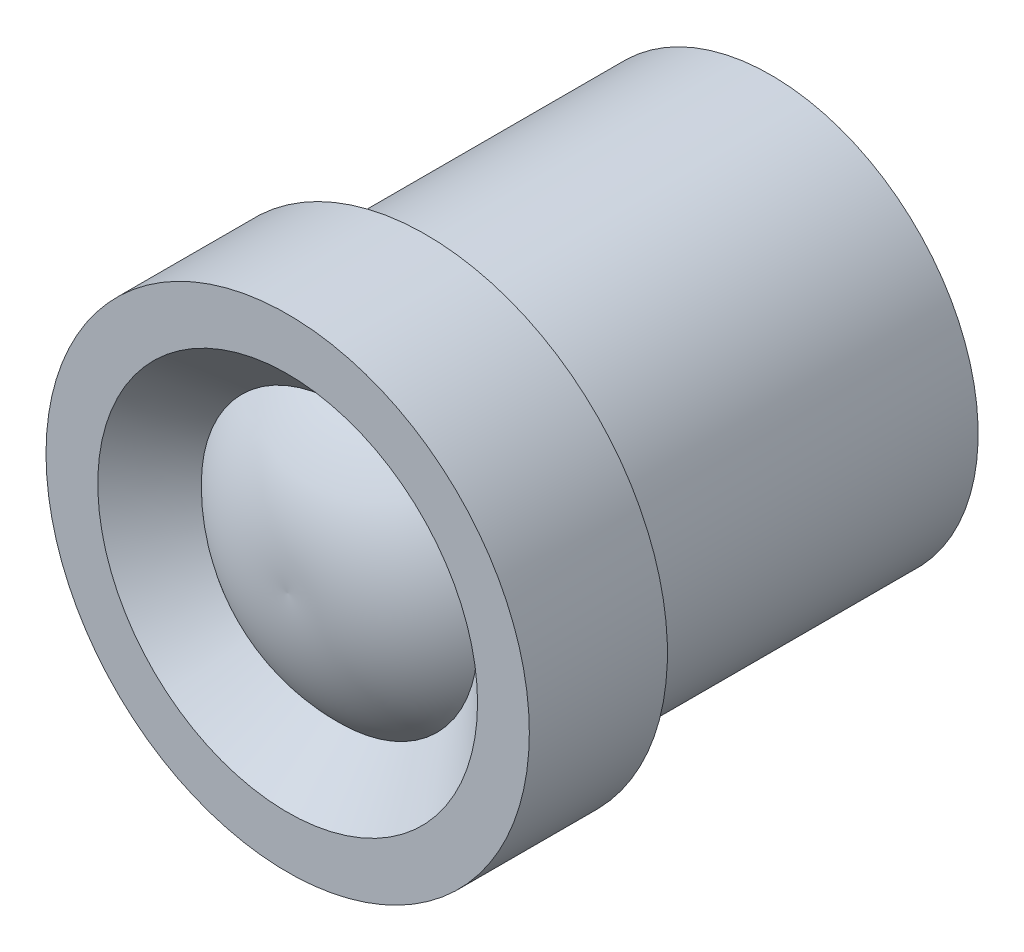
ISO-10303-21;
HEADER;
FILE_DESCRIPTION(('STEP AP214'),'2;1');
FILE_NAME('part.step','',(''),(''),'','','');
FILE_SCHEMA(('AUTOMOTIVE_DESIGN { 1 0 10303 214 1 1 1 1 }'));
ENDSEC;
DATA;
#1=APPLICATION_CONTEXT('core data for automotive mechanical design processes');
#2=APPLICATION_PROTOCOL_DEFINITION('international standard','automotive_design',2000,#1);
#3=PRODUCT_CONTEXT('',#1,'mechanical');
#4=PRODUCT('Part','Part','',(#3));
#5=PRODUCT_RELATED_PRODUCT_CATEGORY('part','',(#4));
#6=PRODUCT_DEFINITION_FORMATION('','',#4);
#7=PRODUCT_DEFINITION_CONTEXT('part definition',#1,'design');
#8=PRODUCT_DEFINITION('design','',#6,#7);
#9=PRODUCT_DEFINITION_SHAPE('','',#8);
#10=(LENGTH_UNIT() NAMED_UNIT(*) SI_UNIT(.MILLI.,.METRE.));
#11=(NAMED_UNIT(*) PLANE_ANGLE_UNIT() SI_UNIT($,.RADIAN.));
#12=(NAMED_UNIT(*) SI_UNIT($,.STERADIAN.) SOLID_ANGLE_UNIT());
#13=UNCERTAINTY_MEASURE_WITH_UNIT(LENGTH_MEASURE(1.E-05),#10,'distance_accuracy_value','');
#14=(GEOMETRIC_REPRESENTATION_CONTEXT(3) GLOBAL_UNCERTAINTY_ASSIGNED_CONTEXT((#13)) GLOBAL_UNIT_ASSIGNED_CONTEXT((#10,
#11,#12)) REPRESENTATION_CONTEXT('',''));
#15=CARTESIAN_POINT('',(0.,0.,0.));
#16=DIRECTION('',(0.,0.,1.));
#17=DIRECTION('',(1.,0.,0.));
#18=AXIS2_PLACEMENT_3D('',#15,#16,#17);
#19=CARTESIAN_POINT('',(0.,0.,14.));
#20=DIRECTION('',(0.,0.,-1.));
#21=DIRECTION('',(-1.,0.,0.));
#22=AXIS2_PLACEMENT_3D('',#19,#20,#21);
#23=CYLINDRICAL_SURFACE('',#22,7.);
#24=CARTESIAN_POINT('',(0.,0.,14.));
#25=DIRECTION('',(0.,0.,1.));
#26=DIRECTION('',(1.,0.,0.));
#27=AXIS2_PLACEMENT_3D('',#24,#25,#26);
#28=CIRCLE('',#27,7.);
#29=CARTESIAN_POINT('',(6.99999999999999,0.,14.));
#30=VERTEX_POINT('',#29);
#31=EDGE_CURVE('E12',#30,#30,#28,.T.);
#32=ORIENTED_EDGE('',*,*,#31,.F.);
#33=EDGE_LOOP('',(#32));
#34=FACE_BOUND('',#33,.T.);
#35=CARTESIAN_POINT('',(0.,0.,10.));
#36=DIRECTION('',(0.,0.,-1.));
#37=DIRECTION('',(-1.,0.,0.));
#38=AXIS2_PLACEMENT_3D('',#35,#36,#37);
#39=CIRCLE('',#38,7.);
#40=CARTESIAN_POINT('',(-7.00000000000001,0.,10.));
#41=VERTEX_POINT('',#40);
#42=EDGE_CURVE('E40',#41,#41,#39,.T.);
#43=ORIENTED_EDGE('',*,*,#42,.F.);
#44=EDGE_LOOP('',(#43));
#45=FACE_BOUND('',#44,.T.);
#46=ADVANCED_FACE('F37',(#34,#45),#23,.T.);
#47=CARTESIAN_POINT('',(0.,0.,14.));
#48=DIRECTION('',(0.,0.,1.));
#49=DIRECTION('',(1.,0.,0.));
#50=AXIS2_PLACEMENT_3D('',#47,#48,#49);
#51=PLANE('',#50);
#52=CARTESIAN_POINT('',(0.,0.,14.));
#53=DIRECTION('',(0.,0.,1.));
#54=DIRECTION('',(1.,0.,0.));
#55=AXIS2_PLACEMENT_3D('',#52,#53,#54);
#56=CIRCLE('',#55,5.5);
#57=CARTESIAN_POINT('',(5.49999999999999,0.,14.));
#58=VERTEX_POINT('',#57);
#59=EDGE_CURVE('E55',#58,#58,#56,.T.);
#60=ORIENTED_EDGE('',*,*,#59,.F.);
#61=EDGE_LOOP('',(#60));
#62=FACE_BOUND('',#61,.T.);
#63=ORIENTED_EDGE('',*,*,#31,.T.);
#64=EDGE_LOOP('',(#63));
#65=FACE_BOUND('',#64,.T.);
#66=ADVANCED_FACE('F78',(#62,#65),#51,.T.);
#67=CARTESIAN_POINT('',(0.,0.,10.));
#68=DIRECTION('',(0.,0.,-1.));
#69=DIRECTION('',(-1.,0.,0.));
#70=AXIS2_PLACEMENT_3D('',#67,#68,#69);
#71=PLANE('',#70);
#72=CARTESIAN_POINT('',(0.,0.,10.));
#73=DIRECTION('',(0.,0.,-1.));
#74=DIRECTION('',(-1.,0.,0.));
#75=AXIS2_PLACEMENT_3D('',#72,#73,#74);
#76=CIRCLE('',#75,6.);
#77=CARTESIAN_POINT('',(-6.00000000000002,0.,10.));
#78=VERTEX_POINT('',#77);
#79=EDGE_CURVE('E61',#78,#78,#76,.T.);
#80=ORIENTED_EDGE('',*,*,#79,.F.);
#81=EDGE_LOOP('',(#80));
#82=FACE_BOUND('',#81,.T.);
#83=ORIENTED_EDGE('',*,*,#42,.T.);
#84=EDGE_LOOP('',(#83));
#85=FACE_BOUND('',#84,.T.);
#86=ADVANCED_FACE('F71',(#82,#85),#71,.T.);
#87=CARTESIAN_POINT('',(0.,0.,10.));
#88=DIRECTION('',(0.,0.,-1.));
#89=DIRECTION('',(-1.,0.,0.));
#90=AXIS2_PLACEMENT_3D('',#87,#88,#89);
#91=CYLINDRICAL_SURFACE('',#90,6.);
#92=ORIENTED_EDGE('',*,*,#79,.T.);
#93=EDGE_LOOP('',(#92));
#94=FACE_BOUND('',#93,.T.);
#95=CARTESIAN_POINT('',(0.,0.,0.));
#96=DIRECTION('',(0.,0.,-1.));
#97=DIRECTION('',(-1.,0.,0.));
#98=AXIS2_PLACEMENT_3D('',#95,#96,#97);
#99=CIRCLE('',#98,6.);
#100=CARTESIAN_POINT('',(-6.,0.,0.));
#101=VERTEX_POINT('',#100);
#102=EDGE_CURVE('E58',#101,#101,#99,.T.);
#103=ORIENTED_EDGE('',*,*,#102,.F.);
#104=EDGE_LOOP('',(#103));
#105=FACE_BOUND('',#104,.T.);
#106=ADVANCED_FACE('F69',(#94,#105),#91,.T.);
#107=CARTESIAN_POINT('',(0.,0.,0.));
#108=DIRECTION('',(0.,0.,1.));
#109=DIRECTION('',(1.,0.,0.));
#110=AXIS2_PLACEMENT_3D('',#107,#108,#109);
#111=PLANE('',#110);
#112=ORIENTED_EDGE('',*,*,#102,.T.);
#113=EDGE_LOOP('',(#112));
#114=FACE_BOUND('',#113,.T.);
#115=ADVANCED_FACE('F67',(#114),#111,.F.);
#116=CARTESIAN_POINT('',(0.,0.,14.));
#117=DIRECTION('',(0.,0.,1.));
#118=DIRECTION('',(1.,0.,0.));
#119=AXIS2_PLACEMENT_3D('',#116,#117,#118);
#120=CONICAL_SURFACE('',#119,5.5,0.78539816339745);
#121=CARTESIAN_POINT('',(0.,0.,12.5));
#122=DIRECTION('',(0.,0.,1.));
#123=DIRECTION('',(1.,0.,0.));
#124=AXIS2_PLACEMENT_3D('',#121,#122,#123);
#125=CIRCLE('',#124,3.99999999999999);
#126=CARTESIAN_POINT('',(3.99999999999998,0.,12.5));
#127=VERTEX_POINT('',#126);
#128=EDGE_CURVE('E53',#127,#127,#125,.T.);
#129=ORIENTED_EDGE('',*,*,#128,.F.);
#130=EDGE_LOOP('',(#129));
#131=FACE_BOUND('',#130,.T.);
#132=ORIENTED_EDGE('',*,*,#59,.T.);
#133=EDGE_LOOP('',(#132));
#134=FACE_BOUND('',#133,.T.);
#135=ADVANCED_FACE('F49',(#131,#134),#120,.F.);
#136=CARTESIAN_POINT('',(-0.412646296245891,0.,9.01705678998901));
#137=DIRECTION('',(0.,-1.,0.));
#138=DIRECTION('',(-1.,0.,0.));
#139=AXIS2_PLACEMENT_3D('',#136,#137,#138);
#140=CIRCLE('',#139,5.);
#141=TRIMMED_CURVE('',#140,(PARAMETER_VALUE(-1.65341955990417)),
(PARAMETER_VALUE(1.65341955990417)),.T.,.PARAMETER.);
#142=CARTESIAN_POINT('',(0.,0.,9.01705678998901));
#143=DIRECTION('',(0.,0.,-1.));
#144=AXIS1_PLACEMENT('',#142,#143);
#145=SURFACE_OF_REVOLUTION('',#141,#144);
#146=CARTESIAN_POINT('',(0.,0.,14.));
#147=VERTEX_POINT('',#146);
#148=VERTEX_LOOP('',#147);
#149=FACE_BOUND('',#148,.T.);
#150=ORIENTED_EDGE('',*,*,#128,.T.);
#151=EDGE_LOOP('',(#150));
#152=FACE_BOUND('',#151,.T.);
#153=ADVANCED_FACE('F46',(#149,#152),#145,.T.);
#154=CLOSED_SHELL('',(#46,#66,#86,#106,#115,#135,#153));
#155=MANIFOLD_SOLID_BREP('B2',#154);
#156=ADVANCED_BREP_SHAPE_REPRESENTATION('',(#18,#155),#14);
#157=SHAPE_DEFINITION_REPRESENTATION(#9,#156);
ENDSEC;
END-ISO-10303-21;
